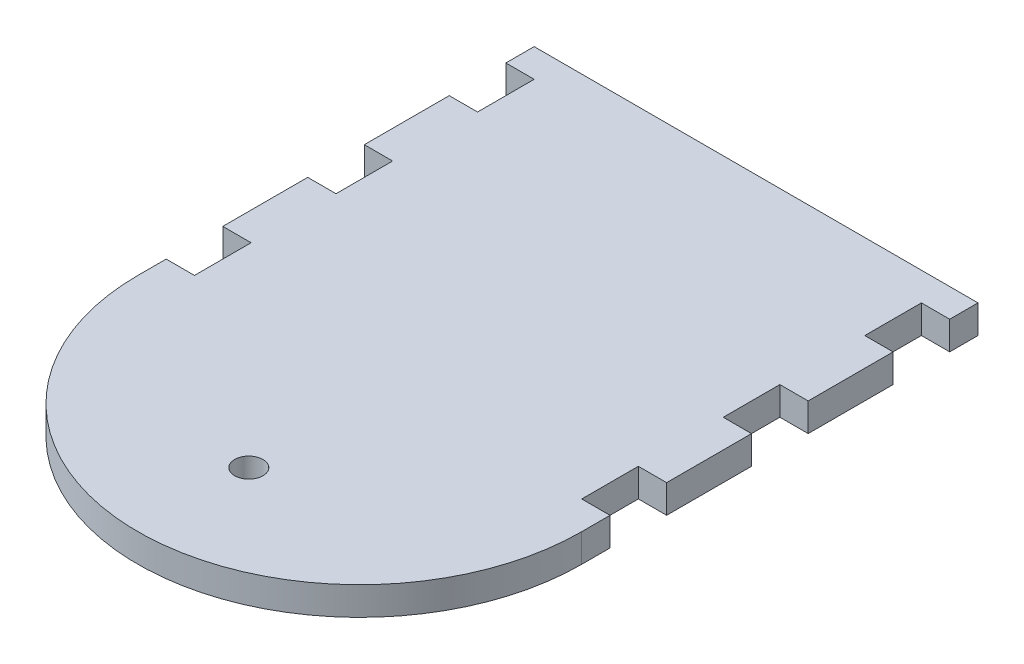
ISO-10303-21;
HEADER;
FILE_DESCRIPTION(('STEP AP214'),'2;1');
FILE_NAME('part.step','',(''),(''),'','','');
FILE_SCHEMA(('AUTOMOTIVE_DESIGN { 1 0 10303 214 1 1 1 1 }'));
ENDSEC;
DATA;
#1=APPLICATION_CONTEXT('core data for automotive mechanical design processes');
#2=APPLICATION_PROTOCOL_DEFINITION('international standard','automotive_design',2000,#1);
#3=PRODUCT_CONTEXT('',#1,'mechanical');
#4=PRODUCT('Part','Part','',(#3));
#5=PRODUCT_RELATED_PRODUCT_CATEGORY('part','',(#4));
#6=PRODUCT_DEFINITION_FORMATION('','',#4);
#7=PRODUCT_DEFINITION_CONTEXT('part definition',#1,'design');
#8=PRODUCT_DEFINITION('design','',#6,#7);
#9=PRODUCT_DEFINITION_SHAPE('','',#8);
#10=(LENGTH_UNIT() NAMED_UNIT(*) SI_UNIT(.MILLI.,.METRE.));
#11=(NAMED_UNIT(*) PLANE_ANGLE_UNIT() SI_UNIT($,.RADIAN.));
#12=(NAMED_UNIT(*) SI_UNIT($,.STERADIAN.) SOLID_ANGLE_UNIT());
#13=UNCERTAINTY_MEASURE_WITH_UNIT(LENGTH_MEASURE(1.E-05),#10,'distance_accuracy_value','');
#14=(GEOMETRIC_REPRESENTATION_CONTEXT(3) GLOBAL_UNCERTAINTY_ASSIGNED_CONTEXT((#13)) GLOBAL_UNIT_ASSIGNED_CONTEXT((#10,
#11,#12)) REPRESENTATION_CONTEXT('',''));
#15=CARTESIAN_POINT('',(0.,0.,0.));
#16=DIRECTION('',(0.,0.,1.));
#17=DIRECTION('',(1.,0.,0.));
#18=AXIS2_PLACEMENT_3D('',#15,#16,#17);
#19=CARTESIAN_POINT('',(0.,6.35,44.4499999999999));
#20=DIRECTION('',(0.,1.,0.));
#21=DIRECTION('',(0.,0.,1.));
#22=AXIS2_PLACEMENT_3D('',#19,#20,#21);
#23=PLANE('',#22);
#24=CARTESIAN_POINT('',(0.,6.35,44.4499999999999));
#25=DIRECTION('',(0.,1.,0.));
#26=DIRECTION('',(0.,0.,1.));
#27=AXIS2_PLACEMENT_3D('',#24,#25,#26);
#28=CIRCLE('',#27,49.784);
#29=CARTESIAN_POINT('',(-49.784,6.35,44.45));
#30=VERTEX_POINT('',#29);
#31=CARTESIAN_POINT('',(49.784,6.35,44.45));
#32=VERTEX_POINT('',#31);
#33=EDGE_CURVE('E305',#30,#32,#28,.T.);
#34=ORIENTED_EDGE('',*,*,#33,.T.);
#35=DIRECTION('',(0.,0.,-1.));
#36=VECTOR('',#35,1.);
#37=CARTESIAN_POINT('',(49.784,6.35,38.1000000000001));
#38=LINE('',#37,#36);
#39=CARTESIAN_POINT('',(49.784,6.35,38.1000000000001));
#40=VERTEX_POINT('',#39);
#41=EDGE_CURVE('E153',#32,#40,#38,.T.);
#42=ORIENTED_EDGE('',*,*,#41,.T.);
#43=DIRECTION('',(-1.,0.,0.));
#44=VECTOR('',#43,1.);
#45=CARTESIAN_POINT('',(43.434,6.35,38.1));
#46=LINE('',#45,#44);
#47=CARTESIAN_POINT('',(43.434,6.35,38.1));
#48=VERTEX_POINT('',#47);
#49=EDGE_CURVE('E380',#40,#48,#46,.T.);
#50=ORIENTED_EDGE('',*,*,#49,.T.);
#51=DIRECTION('',(0.,0.,-1.));
#52=VECTOR('',#51,1.);
#53=CARTESIAN_POINT('',(43.434,6.35,25.4));
#54=LINE('',#53,#52);
#55=CARTESIAN_POINT('',(43.434,6.35,25.4));
#56=VERTEX_POINT('',#55);
#57=EDGE_CURVE('E399',#48,#56,#54,.T.);
#58=ORIENTED_EDGE('',*,*,#57,.T.);
#59=DIRECTION('',(1.,0.,0.));
#60=VECTOR('',#59,1.);
#61=CARTESIAN_POINT('',(49.784,6.35,25.4));
#62=LINE('',#61,#60);
#63=CARTESIAN_POINT('',(49.784,6.35,25.4));
#64=VERTEX_POINT('',#63);
#65=EDGE_CURVE('E396',#56,#64,#62,.T.);
#66=ORIENTED_EDGE('',*,*,#65,.T.);
#67=DIRECTION('',(0.,0.,-1.));
#68=VECTOR('',#67,1.);
#69=CARTESIAN_POINT('',(49.784,6.35,6.35));
#70=LINE('',#69,#68);
#71=CARTESIAN_POINT('',(49.784,6.35,6.35));
#72=VERTEX_POINT('',#71);
#73=EDGE_CURVE('E398',#64,#72,#70,.T.);
#74=ORIENTED_EDGE('',*,*,#73,.T.);
#75=DIRECTION('',(-1.,0.,0.));
#76=VECTOR('',#75,1.);
#77=CARTESIAN_POINT('',(43.434,6.35,6.35));
#78=LINE('',#77,#76);
#79=CARTESIAN_POINT('',(43.434,6.35,6.35));
#80=VERTEX_POINT('',#79);
#81=EDGE_CURVE('E401',#72,#80,#78,.T.);
#82=ORIENTED_EDGE('',*,*,#81,.T.);
#83=DIRECTION('',(0.,0.,-1.));
#84=VECTOR('',#83,1.);
#85=CARTESIAN_POINT('',(43.434,6.35,-6.35));
#86=LINE('',#85,#84);
#87=CARTESIAN_POINT('',(43.434,6.35,-6.35));
#88=VERTEX_POINT('',#87);
#89=EDGE_CURVE('E407',#80,#88,#86,.T.);
#90=ORIENTED_EDGE('',*,*,#89,.T.);
#91=DIRECTION('',(1.,0.,0.));
#92=VECTOR('',#91,1.);
#93=CARTESIAN_POINT('',(49.784,6.35,-6.35));
#94=LINE('',#93,#92);
#95=CARTESIAN_POINT('',(49.784,6.35,-6.35));
#96=VERTEX_POINT('',#95);
#97=EDGE_CURVE('E409',#88,#96,#94,.T.);
#98=ORIENTED_EDGE('',*,*,#97,.T.);
#99=DIRECTION('',(0.,0.,-1.));
#100=VECTOR('',#99,1.);
#101=CARTESIAN_POINT('',(49.784,6.35,-25.4));
#102=LINE('',#101,#100);
#103=CARTESIAN_POINT('',(49.784,6.35,-25.4));
#104=VERTEX_POINT('',#103);
#105=EDGE_CURVE('E411',#96,#104,#102,.T.);
#106=ORIENTED_EDGE('',*,*,#105,.T.);
#107=DIRECTION('',(-1.,0.,0.));
#108=VECTOR('',#107,1.);
#109=CARTESIAN_POINT('',(43.434,6.35,-25.4));
#110=LINE('',#109,#108);
#111=CARTESIAN_POINT('',(43.434,6.35,-25.4));
#112=VERTEX_POINT('',#111);
#113=EDGE_CURVE('E413',#104,#112,#110,.T.);
#114=ORIENTED_EDGE('',*,*,#113,.T.);
#115=DIRECTION('',(0.,0.,-1.));
#116=VECTOR('',#115,1.);
#117=CARTESIAN_POINT('',(43.434,6.35,-38.1));
#118=LINE('',#117,#116);
#119=CARTESIAN_POINT('',(43.434,6.35,-38.1));
#120=VERTEX_POINT('',#119);
#121=EDGE_CURVE('E415',#112,#120,#118,.T.);
#122=ORIENTED_EDGE('',*,*,#121,.T.);
#123=DIRECTION('',(1.,0.,0.));
#124=VECTOR('',#123,1.);
#125=CARTESIAN_POINT('',(49.784,6.35,-38.1));
#126=LINE('',#125,#124);
#127=CARTESIAN_POINT('',(49.784,6.35,-38.1));
#128=VERTEX_POINT('',#127);
#129=EDGE_CURVE('E417',#120,#128,#126,.T.);
#130=ORIENTED_EDGE('',*,*,#129,.T.);
#131=DIRECTION('',(0.,0.,-1.));
#132=VECTOR('',#131,1.);
#133=CARTESIAN_POINT('',(49.784,6.35,-44.45));
#134=LINE('',#133,#132);
#135=CARTESIAN_POINT('',(49.784,6.35,-44.45));
#136=VERTEX_POINT('',#135);
#137=EDGE_CURVE('E419',#128,#136,#134,.T.);
#138=ORIENTED_EDGE('',*,*,#137,.T.);
#139=DIRECTION('',(-1.,0.,0.));
#140=VECTOR('',#139,1.);
#141=CARTESIAN_POINT('',(-49.784,6.35,-44.45));
#142=LINE('',#141,#140);
#143=CARTESIAN_POINT('',(-49.784,6.35,-44.45));
#144=VERTEX_POINT('',#143);
#145=EDGE_CURVE('E421',#136,#144,#142,.T.);
#146=ORIENTED_EDGE('',*,*,#145,.T.);
#147=DIRECTION('',(0.,0.,1.));
#148=VECTOR('',#147,1.);
#149=CARTESIAN_POINT('',(-49.784,6.35,-44.45));
#150=LINE('',#149,#148);
#151=CARTESIAN_POINT('',(-49.784,6.35,-38.0999999999999));
#152=VERTEX_POINT('',#151);
#153=EDGE_CURVE('E423',#144,#152,#150,.T.);
#154=ORIENTED_EDGE('',*,*,#153,.T.);
#155=DIRECTION('',(1.,0.,0.));
#156=VECTOR('',#155,1.);
#157=CARTESIAN_POINT('',(-49.784,6.35,-38.0999999999999));
#158=LINE('',#157,#156);
#159=CARTESIAN_POINT('',(-43.434,6.35,-38.0999999999999));
#160=VERTEX_POINT('',#159);
#161=EDGE_CURVE('E425',#152,#160,#158,.T.);
#162=ORIENTED_EDGE('',*,*,#161,.T.);
#163=DIRECTION('',(0.,0.,1.));
#164=VECTOR('',#163,1.);
#165=CARTESIAN_POINT('',(-43.434,6.35,-38.0999999999999));
#166=LINE('',#165,#164);
#167=CARTESIAN_POINT('',(-43.434,6.35,-25.4));
#168=VERTEX_POINT('',#167);
#169=EDGE_CURVE('E427',#160,#168,#166,.T.);
#170=ORIENTED_EDGE('',*,*,#169,.T.);
#171=DIRECTION('',(-1.,0.,0.));
#172=VECTOR('',#171,1.);
#173=CARTESIAN_POINT('',(-43.434,6.35,-25.4));
#174=LINE('',#173,#172);
#175=CARTESIAN_POINT('',(-49.784,6.35,-25.4));
#176=VERTEX_POINT('',#175);
#177=EDGE_CURVE('E429',#168,#176,#174,.T.);
#178=ORIENTED_EDGE('',*,*,#177,.T.);
#179=DIRECTION('',(0.,0.,1.));
#180=VECTOR('',#179,1.);
#181=CARTESIAN_POINT('',(-49.784,6.35,-25.4));
#182=LINE('',#181,#180);
#183=CARTESIAN_POINT('',(-49.784,6.35,-6.34999999999999));
#184=VERTEX_POINT('',#183);
#185=EDGE_CURVE('E431',#176,#184,#182,.T.);
#186=ORIENTED_EDGE('',*,*,#185,.T.);
#187=DIRECTION('',(1.,0.,0.));
#188=VECTOR('',#187,1.);
#189=CARTESIAN_POINT('',(-49.784,6.35,-6.34999999999999));
#190=LINE('',#189,#188);
#191=CARTESIAN_POINT('',(-43.434,6.35,-6.34999999999999));
#192=VERTEX_POINT('',#191);
#193=EDGE_CURVE('E433',#184,#192,#190,.T.);
#194=ORIENTED_EDGE('',*,*,#193,.T.);
#195=DIRECTION('',(0.,0.,1.));
#196=VECTOR('',#195,1.);
#197=CARTESIAN_POINT('',(-43.434,6.35,-6.34999999999999));
#198=LINE('',#197,#196);
#199=CARTESIAN_POINT('',(-43.434,6.35,6.35000000000001));
#200=VERTEX_POINT('',#199);
#201=EDGE_CURVE('E435',#192,#200,#198,.T.);
#202=ORIENTED_EDGE('',*,*,#201,.T.);
#203=DIRECTION('',(-1.,0.,0.));
#204=VECTOR('',#203,1.);
#205=CARTESIAN_POINT('',(-43.434,6.35,6.35000000000001));
#206=LINE('',#205,#204);
#207=CARTESIAN_POINT('',(-49.784,6.35,6.35000000000001));
#208=VERTEX_POINT('',#207);
#209=EDGE_CURVE('E437',#200,#208,#206,.T.);
#210=ORIENTED_EDGE('',*,*,#209,.T.);
#211=DIRECTION('',(0.,0.,1.));
#212=VECTOR('',#211,1.);
#213=CARTESIAN_POINT('',(-49.784,6.35,6.35000000000001));
#214=LINE('',#213,#212);
#215=CARTESIAN_POINT('',(-49.784,6.35,25.4));
#216=VERTEX_POINT('',#215);
#217=EDGE_CURVE('E439',#208,#216,#214,.T.);
#218=ORIENTED_EDGE('',*,*,#217,.T.);
#219=DIRECTION('',(1.,0.,0.));
#220=VECTOR('',#219,1.);
#221=CARTESIAN_POINT('',(-49.784,6.35,25.4));
#222=LINE('',#221,#220);
#223=CARTESIAN_POINT('',(-43.434,6.35,25.4));
#224=VERTEX_POINT('',#223);
#225=EDGE_CURVE('E232',#216,#224,#222,.T.);
#226=ORIENTED_EDGE('',*,*,#225,.T.);
#227=DIRECTION('',(0.,0.,1.));
#228=VECTOR('',#227,1.);
#229=CARTESIAN_POINT('',(-43.434,6.35,25.4));
#230=LINE('',#229,#228);
#231=CARTESIAN_POINT('',(-43.434,6.35,38.1000000000001));
#232=VERTEX_POINT('',#231);
#233=EDGE_CURVE('E226',#224,#232,#230,.T.);
#234=ORIENTED_EDGE('',*,*,#233,.T.);
#235=DIRECTION('',(-1.,0.,0.));
#236=VECTOR('',#235,1.);
#237=CARTESIAN_POINT('',(-43.434,6.35,38.1000000000001));
#238=LINE('',#237,#236);
#239=CARTESIAN_POINT('',(-49.784,6.35,38.1000000000001));
#240=VERTEX_POINT('',#239);
#241=EDGE_CURVE('E230',#232,#240,#238,.T.);
#242=ORIENTED_EDGE('',*,*,#241,.T.);
#243=DIRECTION('',(0.,0.,1.));
#244=VECTOR('',#243,1.);
#245=CARTESIAN_POINT('',(-49.784,6.35,38.1000000000001));
#246=LINE('',#245,#244);
#247=EDGE_CURVE('E50',#240,#30,#246,.T.);
#248=ORIENTED_EDGE('',*,*,#247,.T.);
#249=EDGE_LOOP('',(#34,#42,#50,#58,#66,#74,#82,#90,#98,#106,#114,#122,#130,#138,#146,#154,#162,
#170,#178,#186,#194,#202,#210,#218,#226,#234,#242,#248));
#250=FACE_BOUND('',#249,.T.);
#251=CARTESIAN_POINT('',(0.,6.35,69.342));
#252=DIRECTION('',(0.,1.,0.));
#253=DIRECTION('',(0.,0.,1.));
#254=AXIS2_PLACEMENT_3D('',#251,#252,#253);
#255=CIRCLE('',#254,3.175);
#256=CARTESIAN_POINT('',(0.,6.35,72.517));
#257=VERTEX_POINT('',#256);
#258=EDGE_CURVE('E254',#257,#257,#255,.T.);
#259=ORIENTED_EDGE('',*,*,#258,.F.);
#260=EDGE_LOOP('',(#259));
#261=FACE_BOUND('',#260,.T.);
#262=ADVANCED_FACE('F33',(#250,#261),#23,.T.);
#263=CARTESIAN_POINT('',(0.,0.,44.4499999999999));
#264=DIRECTION('',(0.,1.,0.));
#265=DIRECTION('',(0.,0.,1.));
#266=AXIS2_PLACEMENT_3D('',#263,#264,#265);
#267=PLANE('',#266);
#268=CARTESIAN_POINT('',(0.,0.,44.4499999999999));
#269=DIRECTION('',(0.,1.,0.));
#270=DIRECTION('',(0.,0.,1.));
#271=AXIS2_PLACEMENT_3D('',#268,#269,#270);
#272=CIRCLE('',#271,49.784);
#273=CARTESIAN_POINT('',(-49.784,0.,44.45));
#274=VERTEX_POINT('',#273);
#275=CARTESIAN_POINT('',(49.784,0.,44.45));
#276=VERTEX_POINT('',#275);
#277=EDGE_CURVE('E250',#274,#276,#272,.T.);
#278=ORIENTED_EDGE('',*,*,#277,.F.);
#279=DIRECTION('',(0.,0.,1.));
#280=VECTOR('',#279,1.);
#281=CARTESIAN_POINT('',(-49.784,0.,38.1000000000001));
#282=LINE('',#281,#280);
#283=CARTESIAN_POINT('',(-49.784,0.,38.1000000000001));
#284=VERTEX_POINT('',#283);
#285=EDGE_CURVE('E145',#284,#274,#282,.T.);
#286=ORIENTED_EDGE('',*,*,#285,.F.);
#287=DIRECTION('',(-1.,0.,0.));
#288=VECTOR('',#287,1.);
#289=CARTESIAN_POINT('',(-43.434,0.,38.1000000000001));
#290=LINE('',#289,#288);
#291=CARTESIAN_POINT('',(-43.434,0.,38.1000000000001));
#292=VERTEX_POINT('',#291);
#293=EDGE_CURVE('E139',#292,#284,#290,.T.);
#294=ORIENTED_EDGE('',*,*,#293,.F.);
#295=DIRECTION('',(0.,0.,1.));
#296=VECTOR('',#295,1.);
#297=CARTESIAN_POINT('',(-43.434,0.,25.4));
#298=LINE('',#297,#296);
#299=CARTESIAN_POINT('',(-43.434,0.,25.4));
#300=VERTEX_POINT('',#299);
#301=EDGE_CURVE('E240',#300,#292,#298,.T.);
#302=ORIENTED_EDGE('',*,*,#301,.F.);
#303=DIRECTION('',(1.,0.,0.));
#304=VECTOR('',#303,1.);
#305=CARTESIAN_POINT('',(-49.784,0.,25.4));
#306=LINE('',#305,#304);
#307=CARTESIAN_POINT('',(-49.784,0.,25.4));
#308=VERTEX_POINT('',#307);
#309=EDGE_CURVE('E300',#308,#300,#306,.T.);
#310=ORIENTED_EDGE('',*,*,#309,.F.);
#311=DIRECTION('',(0.,0.,1.));
#312=VECTOR('',#311,1.);
#313=CARTESIAN_POINT('',(-49.784,0.,6.35000000000001));
#314=LINE('',#313,#312);
#315=CARTESIAN_POINT('',(-49.784,0.,6.35000000000001));
#316=VERTEX_POINT('',#315);
#317=EDGE_CURVE('E298',#316,#308,#314,.T.);
#318=ORIENTED_EDGE('',*,*,#317,.F.);
#319=DIRECTION('',(-1.,0.,0.));
#320=VECTOR('',#319,1.);
#321=CARTESIAN_POINT('',(-43.434,0.,6.35000000000001));
#322=LINE('',#321,#320);
#323=CARTESIAN_POINT('',(-43.434,0.,6.35000000000001));
#324=VERTEX_POINT('',#323);
#325=EDGE_CURVE('E296',#324,#316,#322,.T.);
#326=ORIENTED_EDGE('',*,*,#325,.F.);
#327=DIRECTION('',(0.,0.,1.));
#328=VECTOR('',#327,1.);
#329=CARTESIAN_POINT('',(-43.434,0.,-6.34999999999999));
#330=LINE('',#329,#328);
#331=CARTESIAN_POINT('',(-43.434,0.,-6.34999999999999));
#332=VERTEX_POINT('',#331);
#333=EDGE_CURVE('E294',#332,#324,#330,.T.);
#334=ORIENTED_EDGE('',*,*,#333,.F.);
#335=DIRECTION('',(1.,0.,0.));
#336=VECTOR('',#335,1.);
#337=CARTESIAN_POINT('',(-49.784,0.,-6.34999999999999));
#338=LINE('',#337,#336);
#339=CARTESIAN_POINT('',(-49.784,0.,-6.34999999999999));
#340=VERTEX_POINT('',#339);
#341=EDGE_CURVE('E292',#340,#332,#338,.T.);
#342=ORIENTED_EDGE('',*,*,#341,.F.);
#343=DIRECTION('',(0.,0.,1.));
#344=VECTOR('',#343,1.);
#345=CARTESIAN_POINT('',(-49.784,0.,-25.4));
#346=LINE('',#345,#344);
#347=CARTESIAN_POINT('',(-49.784,0.,-25.4));
#348=VERTEX_POINT('',#347);
#349=EDGE_CURVE('E290',#348,#340,#346,.T.);
#350=ORIENTED_EDGE('',*,*,#349,.F.);
#351=DIRECTION('',(-1.,0.,0.));
#352=VECTOR('',#351,1.);
#353=CARTESIAN_POINT('',(-43.434,0.,-25.4));
#354=LINE('',#353,#352);
#355=CARTESIAN_POINT('',(-43.434,0.,-25.4));
#356=VERTEX_POINT('',#355);
#357=EDGE_CURVE('E288',#356,#348,#354,.T.);
#358=ORIENTED_EDGE('',*,*,#357,.F.);
#359=DIRECTION('',(0.,0.,1.));
#360=VECTOR('',#359,1.);
#361=CARTESIAN_POINT('',(-43.434,0.,-38.0999999999999));
#362=LINE('',#361,#360);
#363=CARTESIAN_POINT('',(-43.434,0.,-38.0999999999999));
#364=VERTEX_POINT('',#363);
#365=EDGE_CURVE('E286',#364,#356,#362,.T.);
#366=ORIENTED_EDGE('',*,*,#365,.F.);
#367=DIRECTION('',(1.,0.,0.));
#368=VECTOR('',#367,1.);
#369=CARTESIAN_POINT('',(-49.784,0.,-38.0999999999999));
#370=LINE('',#369,#368);
#371=CARTESIAN_POINT('',(-49.784,0.,-38.0999999999999));
#372=VERTEX_POINT('',#371);
#373=EDGE_CURVE('E284',#372,#364,#370,.T.);
#374=ORIENTED_EDGE('',*,*,#373,.F.);
#375=DIRECTION('',(0.,0.,1.));
#376=VECTOR('',#375,1.);
#377=CARTESIAN_POINT('',(-49.784,0.,-44.45));
#378=LINE('',#377,#376);
#379=CARTESIAN_POINT('',(-49.784,0.,-44.45));
#380=VERTEX_POINT('',#379);
#381=EDGE_CURVE('E282',#380,#372,#378,.T.);
#382=ORIENTED_EDGE('',*,*,#381,.F.);
#383=DIRECTION('',(-1.,0.,0.));
#384=VECTOR('',#383,1.);
#385=CARTESIAN_POINT('',(-49.784,0.,-44.45));
#386=LINE('',#385,#384);
#387=CARTESIAN_POINT('',(49.784,0.,-44.45));
#388=VERTEX_POINT('',#387);
#389=EDGE_CURVE('E280',#388,#380,#386,.T.);
#390=ORIENTED_EDGE('',*,*,#389,.F.);
#391=DIRECTION('',(0.,0.,-1.));
#392=VECTOR('',#391,1.);
#393=CARTESIAN_POINT('',(49.784,0.,-44.45));
#394=LINE('',#393,#392);
#395=CARTESIAN_POINT('',(49.784,0.,-38.1));
#396=VERTEX_POINT('',#395);
#397=EDGE_CURVE('E278',#396,#388,#394,.T.);
#398=ORIENTED_EDGE('',*,*,#397,.F.);
#399=DIRECTION('',(1.,0.,0.));
#400=VECTOR('',#399,1.);
#401=CARTESIAN_POINT('',(49.784,0.,-38.1));
#402=LINE('',#401,#400);
#403=CARTESIAN_POINT('',(43.434,0.,-38.1));
#404=VERTEX_POINT('',#403);
#405=EDGE_CURVE('E276',#404,#396,#402,.T.);
#406=ORIENTED_EDGE('',*,*,#405,.F.);
#407=DIRECTION('',(0.,0.,-1.));
#408=VECTOR('',#407,1.);
#409=CARTESIAN_POINT('',(43.434,0.,-38.1));
#410=LINE('',#409,#408);
#411=CARTESIAN_POINT('',(43.434,0.,-25.4));
#412=VERTEX_POINT('',#411);
#413=EDGE_CURVE('E274',#412,#404,#410,.T.);
#414=ORIENTED_EDGE('',*,*,#413,.F.);
#415=DIRECTION('',(-1.,0.,0.));
#416=VECTOR('',#415,1.);
#417=CARTESIAN_POINT('',(43.434,0.,-25.4));
#418=LINE('',#417,#416);
#419=CARTESIAN_POINT('',(49.784,0.,-25.4));
#420=VERTEX_POINT('',#419);
#421=EDGE_CURVE('E272',#420,#412,#418,.T.);
#422=ORIENTED_EDGE('',*,*,#421,.F.);
#423=DIRECTION('',(0.,0.,-1.));
#424=VECTOR('',#423,1.);
#425=CARTESIAN_POINT('',(49.784,0.,-25.4));
#426=LINE('',#425,#424);
#427=CARTESIAN_POINT('',(49.784,0.,-6.35));
#428=VERTEX_POINT('',#427);
#429=EDGE_CURVE('E270',#428,#420,#426,.T.);
#430=ORIENTED_EDGE('',*,*,#429,.F.);
#431=DIRECTION('',(1.,0.,0.));
#432=VECTOR('',#431,1.);
#433=CARTESIAN_POINT('',(49.784,0.,-6.35));
#434=LINE('',#433,#432);
#435=CARTESIAN_POINT('',(43.434,0.,-6.35));
#436=VERTEX_POINT('',#435);
#437=EDGE_CURVE('E268',#436,#428,#434,.T.);
#438=ORIENTED_EDGE('',*,*,#437,.F.);
#439=DIRECTION('',(0.,0.,-1.));
#440=VECTOR('',#439,1.);
#441=CARTESIAN_POINT('',(43.434,0.,-6.35));
#442=LINE('',#441,#440);
#443=CARTESIAN_POINT('',(43.434,0.,6.35));
#444=VERTEX_POINT('',#443);
#445=EDGE_CURVE('E266',#444,#436,#442,.T.);
#446=ORIENTED_EDGE('',*,*,#445,.F.);
#447=DIRECTION('',(-1.,0.,0.));
#448=VECTOR('',#447,1.);
#449=CARTESIAN_POINT('',(43.434,0.,6.35));
#450=LINE('',#449,#448);
#451=CARTESIAN_POINT('',(49.784,0.,6.35));
#452=VERTEX_POINT('',#451);
#453=EDGE_CURVE('E264',#452,#444,#450,.T.);
#454=ORIENTED_EDGE('',*,*,#453,.F.);
#455=DIRECTION('',(0.,0.,-1.));
#456=VECTOR('',#455,1.);
#457=CARTESIAN_POINT('',(49.784,0.,6.35));
#458=LINE('',#457,#456);
#459=CARTESIAN_POINT('',(49.784,0.,25.4));
#460=VERTEX_POINT('',#459);
#461=EDGE_CURVE('E262',#460,#452,#458,.T.);
#462=ORIENTED_EDGE('',*,*,#461,.F.);
#463=DIRECTION('',(1.,0.,0.));
#464=VECTOR('',#463,1.);
#465=CARTESIAN_POINT('',(49.784,0.,25.4));
#466=LINE('',#465,#464);
#467=CARTESIAN_POINT('',(43.434,0.,25.4));
#468=VERTEX_POINT('',#467);
#469=EDGE_CURVE('E260',#468,#460,#466,.T.);
#470=ORIENTED_EDGE('',*,*,#469,.F.);
#471=DIRECTION('',(0.,0.,-1.));
#472=VECTOR('',#471,1.);
#473=CARTESIAN_POINT('',(43.434,0.,25.4));
#474=LINE('',#473,#472);
#475=CARTESIAN_POINT('',(43.434,0.,38.1));
#476=VERTEX_POINT('',#475);
#477=EDGE_CURVE('E258',#476,#468,#474,.T.);
#478=ORIENTED_EDGE('',*,*,#477,.F.);
#479=DIRECTION('',(-1.,0.,0.));
#480=VECTOR('',#479,1.);
#481=CARTESIAN_POINT('',(43.434,0.,38.1));
#482=LINE('',#481,#480);
#483=CARTESIAN_POINT('',(49.784,0.,38.1000000000001));
#484=VERTEX_POINT('',#483);
#485=EDGE_CURVE('E256',#484,#476,#482,.T.);
#486=ORIENTED_EDGE('',*,*,#485,.F.);
#487=DIRECTION('',(0.,0.,-1.));
#488=VECTOR('',#487,1.);
#489=CARTESIAN_POINT('',(49.784,0.,38.1000000000001));
#490=LINE('',#489,#488);
#491=EDGE_CURVE('E253',#276,#484,#490,.T.);
#492=ORIENTED_EDGE('',*,*,#491,.F.);
#493=EDGE_LOOP('',(#278,#286,#294,#302,#310,#318,#326,#334,#342,#350,#358,#366,#374,#382,#390,
#398,#406,#414,#422,#430,#438,#446,#454,#462,#470,#478,#486,#492));
#494=FACE_BOUND('',#493,.T.);
#495=CARTESIAN_POINT('',(0.,0.,69.342));
#496=DIRECTION('',(0.,1.,0.));
#497=DIRECTION('',(0.,0.,1.));
#498=AXIS2_PLACEMENT_3D('',#495,#496,#497);
#499=CIRCLE('',#498,3.175);
#500=CARTESIAN_POINT('',(0.,0.,72.517));
#501=VERTEX_POINT('',#500);
#502=EDGE_CURVE('E794',#501,#501,#499,.T.);
#503=ORIENTED_EDGE('',*,*,#502,.T.);
#504=EDGE_LOOP('',(#503));
#505=FACE_BOUND('',#504,.T.);
#506=ADVANCED_FACE('F384',(#494,#505),#267,.F.);
#507=CARTESIAN_POINT('',(0.,6.35,44.4499999999999));
#508=DIRECTION('',(0.,-1.,0.));
#509=DIRECTION('',(0.,0.,-1.));
#510=AXIS2_PLACEMENT_3D('',#507,#508,#509);
#511=CYLINDRICAL_SURFACE('',#510,49.784);
#512=ORIENTED_EDGE('',*,*,#277,.T.);
#513=DIRECTION('',(0.,-1.,0.));
#514=VECTOR('',#513,1.);
#515=CARTESIAN_POINT('',(49.784,6.35,44.45));
#516=LINE('',#515,#514);
#517=EDGE_CURVE('E11',#32,#276,#516,.T.);
#518=ORIENTED_EDGE('',*,*,#517,.F.);
#519=ORIENTED_EDGE('',*,*,#33,.F.);
#520=DIRECTION('',(0.,-1.,0.));
#521=VECTOR('',#520,1.);
#522=CARTESIAN_POINT('',(-49.784,6.35,44.45));
#523=LINE('',#522,#521);
#524=EDGE_CURVE('E246',#30,#274,#523,.T.);
#525=ORIENTED_EDGE('',*,*,#524,.T.);
#526=EDGE_LOOP('',(#512,#518,#519,#525));
#527=FACE_BOUND('',#526,.T.);
#528=ADVANCED_FACE('F35',(#527),#511,.T.);
#529=CARTESIAN_POINT('',(49.784,6.35,38.1000000000001));
#530=DIRECTION('',(-1.,0.,0.));
#531=DIRECTION('',(0.,0.,1.));
#532=AXIS2_PLACEMENT_3D('',#529,#530,#531);
#533=PLANE('',#532);
#534=ORIENTED_EDGE('',*,*,#491,.T.);
#535=DIRECTION('',(0.,-1.,0.));
#536=VECTOR('',#535,1.);
#537=CARTESIAN_POINT('',(49.784,6.35,38.1000000000001));
#538=LINE('',#537,#536);
#539=EDGE_CURVE('E42',#40,#484,#538,.T.);
#540=ORIENTED_EDGE('',*,*,#539,.F.);
#541=ORIENTED_EDGE('',*,*,#41,.F.);
#542=ORIENTED_EDGE('',*,*,#517,.T.);
#543=EDGE_LOOP('',(#534,#540,#541,#542));
#544=FACE_BOUND('',#543,.T.);
#545=ADVANCED_FACE('F473',(#544),#533,.F.);
#546=CARTESIAN_POINT('',(43.434,6.35,38.1));
#547=DIRECTION('',(0.,0.,1.));
#548=DIRECTION('',(1.,0.,0.));
#549=AXIS2_PLACEMENT_3D('',#546,#547,#548);
#550=PLANE('',#549);
#551=ORIENTED_EDGE('',*,*,#485,.T.);
#552=DIRECTION('',(0.,-1.,0.));
#553=VECTOR('',#552,1.);
#554=CARTESIAN_POINT('',(43.434,6.35,38.1));
#555=LINE('',#554,#553);
#556=EDGE_CURVE('E372',#48,#476,#555,.T.);
#557=ORIENTED_EDGE('',*,*,#556,.F.);
#558=ORIENTED_EDGE('',*,*,#49,.F.);
#559=ORIENTED_EDGE('',*,*,#539,.T.);
#560=EDGE_LOOP('',(#551,#557,#558,#559));
#561=FACE_BOUND('',#560,.T.);
#562=ADVANCED_FACE('F378',(#561),#550,.F.);
#563=CARTESIAN_POINT('',(43.434,6.35,25.4));
#564=DIRECTION('',(-1.,0.,0.));
#565=DIRECTION('',(0.,0.,1.));
#566=AXIS2_PLACEMENT_3D('',#563,#564,#565);
#567=PLANE('',#566);
#568=ORIENTED_EDGE('',*,*,#477,.T.);
#569=DIRECTION('',(0.,-1.,0.));
#570=VECTOR('',#569,1.);
#571=CARTESIAN_POINT('',(43.434,6.35,25.4));
#572=LINE('',#571,#570);
#573=EDGE_CURVE('E369',#56,#468,#572,.T.);
#574=ORIENTED_EDGE('',*,*,#573,.F.);
#575=ORIENTED_EDGE('',*,*,#57,.F.);
#576=ORIENTED_EDGE('',*,*,#556,.T.);
#577=EDGE_LOOP('',(#568,#574,#575,#576));
#578=FACE_BOUND('',#577,.T.);
#579=ADVANCED_FACE('F390',(#578),#567,.F.);
#580=CARTESIAN_POINT('',(49.784,6.35,25.4));
#581=DIRECTION('',(0.,0.,-1.));
#582=DIRECTION('',(-1.,0.,0.));
#583=AXIS2_PLACEMENT_3D('',#580,#581,#582);
#584=PLANE('',#583);
#585=ORIENTED_EDGE('',*,*,#469,.T.);
#586=DIRECTION('',(0.,-1.,0.));
#587=VECTOR('',#586,1.);
#588=CARTESIAN_POINT('',(49.784,6.35,25.4));
#589=LINE('',#588,#587);
#590=EDGE_CURVE('E366',#64,#460,#589,.T.);
#591=ORIENTED_EDGE('',*,*,#590,.F.);
#592=ORIENTED_EDGE('',*,*,#65,.F.);
#593=ORIENTED_EDGE('',*,*,#573,.T.);
#594=EDGE_LOOP('',(#585,#591,#592,#593));
#595=FACE_BOUND('',#594,.T.);
#596=ADVANCED_FACE('F394',(#595),#584,.F.);
#597=CARTESIAN_POINT('',(49.784,6.35,6.35));
#598=DIRECTION('',(-1.,0.,0.));
#599=DIRECTION('',(0.,0.,1.));
#600=AXIS2_PLACEMENT_3D('',#597,#598,#599);
#601=PLANE('',#600);
#602=ORIENTED_EDGE('',*,*,#461,.T.);
#603=DIRECTION('',(0.,-1.,0.));
#604=VECTOR('',#603,1.);
#605=CARTESIAN_POINT('',(49.784,6.35,6.35));
#606=LINE('',#605,#604);
#607=EDGE_CURVE('E363',#72,#452,#606,.T.);
#608=ORIENTED_EDGE('',*,*,#607,.F.);
#609=ORIENTED_EDGE('',*,*,#73,.F.);
#610=ORIENTED_EDGE('',*,*,#590,.T.);
#611=EDGE_LOOP('',(#602,#608,#609,#610));
#612=FACE_BOUND('',#611,.T.);
#613=ADVANCED_FACE('F486',(#612),#601,.F.);
#614=CARTESIAN_POINT('',(43.434,6.35,6.35));
#615=DIRECTION('',(0.,0.,1.));
#616=DIRECTION('',(1.,0.,0.));
#617=AXIS2_PLACEMENT_3D('',#614,#615,#616);
#618=PLANE('',#617);
#619=ORIENTED_EDGE('',*,*,#453,.T.);
#620=DIRECTION('',(0.,-1.,0.));
#621=VECTOR('',#620,1.);
#622=CARTESIAN_POINT('',(43.434,6.35,6.35));
#623=LINE('',#622,#621);
#624=EDGE_CURVE('E360',#80,#444,#623,.T.);
#625=ORIENTED_EDGE('',*,*,#624,.F.);
#626=ORIENTED_EDGE('',*,*,#81,.F.);
#627=ORIENTED_EDGE('',*,*,#607,.T.);
#628=EDGE_LOOP('',(#619,#625,#626,#627));
#629=FACE_BOUND('',#628,.T.);
#630=ADVANCED_FACE('F489',(#629),#618,.F.);
#631=CARTESIAN_POINT('',(43.434,6.35,-6.35));
#632=DIRECTION('',(-1.,0.,0.));
#633=DIRECTION('',(0.,0.,1.));
#634=AXIS2_PLACEMENT_3D('',#631,#632,#633);
#635=PLANE('',#634);
#636=ORIENTED_EDGE('',*,*,#445,.T.);
#637=DIRECTION('',(0.,-1.,0.));
#638=VECTOR('',#637,1.);
#639=CARTESIAN_POINT('',(43.434,6.35,-6.35));
#640=LINE('',#639,#638);
#641=EDGE_CURVE('E357',#88,#436,#640,.T.);
#642=ORIENTED_EDGE('',*,*,#641,.F.);
#643=ORIENTED_EDGE('',*,*,#89,.F.);
#644=ORIENTED_EDGE('',*,*,#624,.T.);
#645=EDGE_LOOP('',(#636,#642,#643,#644));
#646=FACE_BOUND('',#645,.T.);
#647=ADVANCED_FACE('F493',(#646),#635,.F.);
#648=CARTESIAN_POINT('',(49.784,6.35,-6.35));
#649=DIRECTION('',(0.,0.,-1.));
#650=DIRECTION('',(-1.,0.,0.));
#651=AXIS2_PLACEMENT_3D('',#648,#649,#650);
#652=PLANE('',#651);
#653=ORIENTED_EDGE('',*,*,#437,.T.);
#654=DIRECTION('',(0.,-1.,0.));
#655=VECTOR('',#654,1.);
#656=CARTESIAN_POINT('',(49.784,6.35,-6.35));
#657=LINE('',#656,#655);
#658=EDGE_CURVE('E354',#96,#428,#657,.T.);
#659=ORIENTED_EDGE('',*,*,#658,.F.);
#660=ORIENTED_EDGE('',*,*,#97,.F.);
#661=ORIENTED_EDGE('',*,*,#641,.T.);
#662=EDGE_LOOP('',(#653,#659,#660,#661));
#663=FACE_BOUND('',#662,.T.);
#664=ADVANCED_FACE('F497',(#663),#652,.F.);
#665=CARTESIAN_POINT('',(49.784,6.35,-25.4));
#666=DIRECTION('',(-1.,0.,0.));
#667=DIRECTION('',(0.,0.,1.));
#668=AXIS2_PLACEMENT_3D('',#665,#666,#667);
#669=PLANE('',#668);
#670=ORIENTED_EDGE('',*,*,#429,.T.);
#671=DIRECTION('',(0.,-1.,0.));
#672=VECTOR('',#671,1.);
#673=CARTESIAN_POINT('',(49.784,6.35,-25.4));
#674=LINE('',#673,#672);
#675=EDGE_CURVE('E351',#104,#420,#674,.T.);
#676=ORIENTED_EDGE('',*,*,#675,.F.);
#677=ORIENTED_EDGE('',*,*,#105,.F.);
#678=ORIENTED_EDGE('',*,*,#658,.T.);
#679=EDGE_LOOP('',(#670,#676,#677,#678));
#680=FACE_BOUND('',#679,.T.);
#681=ADVANCED_FACE('F501',(#680),#669,.F.);
#682=CARTESIAN_POINT('',(43.434,6.35,-25.4));
#683=DIRECTION('',(0.,0.,1.));
#684=DIRECTION('',(1.,0.,0.));
#685=AXIS2_PLACEMENT_3D('',#682,#683,#684);
#686=PLANE('',#685);
#687=ORIENTED_EDGE('',*,*,#421,.T.);
#688=DIRECTION('',(0.,-1.,0.));
#689=VECTOR('',#688,1.);
#690=CARTESIAN_POINT('',(43.434,6.35,-25.4));
#691=LINE('',#690,#689);
#692=EDGE_CURVE('E348',#112,#412,#691,.T.);
#693=ORIENTED_EDGE('',*,*,#692,.F.);
#694=ORIENTED_EDGE('',*,*,#113,.F.);
#695=ORIENTED_EDGE('',*,*,#675,.T.);
#696=EDGE_LOOP('',(#687,#693,#694,#695));
#697=FACE_BOUND('',#696,.T.);
#698=ADVANCED_FACE('F505',(#697),#686,.F.);
#699=CARTESIAN_POINT('',(43.434,6.35,-38.1));
#700=DIRECTION('',(-1.,0.,0.));
#701=DIRECTION('',(0.,0.,1.));
#702=AXIS2_PLACEMENT_3D('',#699,#700,#701);
#703=PLANE('',#702);
#704=ORIENTED_EDGE('',*,*,#413,.T.);
#705=DIRECTION('',(0.,-1.,0.));
#706=VECTOR('',#705,1.);
#707=CARTESIAN_POINT('',(43.434,6.35,-38.1));
#708=LINE('',#707,#706);
#709=EDGE_CURVE('E345',#120,#404,#708,.T.);
#710=ORIENTED_EDGE('',*,*,#709,.F.);
#711=ORIENTED_EDGE('',*,*,#121,.F.);
#712=ORIENTED_EDGE('',*,*,#692,.T.);
#713=EDGE_LOOP('',(#704,#710,#711,#712));
#714=FACE_BOUND('',#713,.T.);
#715=ADVANCED_FACE('F509',(#714),#703,.F.);
#716=CARTESIAN_POINT('',(49.784,6.35,-38.1));
#717=DIRECTION('',(0.,0.,-1.));
#718=DIRECTION('',(-1.,0.,0.));
#719=AXIS2_PLACEMENT_3D('',#716,#717,#718);
#720=PLANE('',#719);
#721=ORIENTED_EDGE('',*,*,#405,.T.);
#722=DIRECTION('',(0.,-1.,0.));
#723=VECTOR('',#722,1.);
#724=CARTESIAN_POINT('',(49.784,6.35,-38.1));
#725=LINE('',#724,#723);
#726=EDGE_CURVE('E342',#128,#396,#725,.T.);
#727=ORIENTED_EDGE('',*,*,#726,.F.);
#728=ORIENTED_EDGE('',*,*,#129,.F.);
#729=ORIENTED_EDGE('',*,*,#709,.T.);
#730=EDGE_LOOP('',(#721,#727,#728,#729));
#731=FACE_BOUND('',#730,.T.);
#732=ADVANCED_FACE('F513',(#731),#720,.F.);
#733=CARTESIAN_POINT('',(49.784,6.35,-44.45));
#734=DIRECTION('',(-1.,0.,0.));
#735=DIRECTION('',(0.,0.,1.));
#736=AXIS2_PLACEMENT_3D('',#733,#734,#735);
#737=PLANE('',#736);
#738=ORIENTED_EDGE('',*,*,#397,.T.);
#739=DIRECTION('',(0.,-1.,0.));
#740=VECTOR('',#739,1.);
#741=CARTESIAN_POINT('',(49.784,6.35,-44.45));
#742=LINE('',#741,#740);
#743=EDGE_CURVE('E339',#136,#388,#742,.T.);
#744=ORIENTED_EDGE('',*,*,#743,.F.);
#745=ORIENTED_EDGE('',*,*,#137,.F.);
#746=ORIENTED_EDGE('',*,*,#726,.T.);
#747=EDGE_LOOP('',(#738,#744,#745,#746));
#748=FACE_BOUND('',#747,.T.);
#749=ADVANCED_FACE('F517',(#748),#737,.F.);
#750=CARTESIAN_POINT('',(-49.784,6.35,-44.45));
#751=DIRECTION('',(0.,0.,1.));
#752=DIRECTION('',(1.,0.,0.));
#753=AXIS2_PLACEMENT_3D('',#750,#751,#752);
#754=PLANE('',#753);
#755=ORIENTED_EDGE('',*,*,#389,.T.);
#756=DIRECTION('',(0.,-1.,0.));
#757=VECTOR('',#756,1.);
#758=CARTESIAN_POINT('',(-49.784,6.35,-44.45));
#759=LINE('',#758,#757);
#760=EDGE_CURVE('E336',#144,#380,#759,.T.);
#761=ORIENTED_EDGE('',*,*,#760,.F.);
#762=ORIENTED_EDGE('',*,*,#145,.F.);
#763=ORIENTED_EDGE('',*,*,#743,.T.);
#764=EDGE_LOOP('',(#755,#761,#762,#763));
#765=FACE_BOUND('',#764,.T.);
#766=ADVANCED_FACE('F521',(#765),#754,.F.);
#767=CARTESIAN_POINT('',(-49.784,6.35,-44.45));
#768=DIRECTION('',(1.,0.,0.));
#769=DIRECTION('',(0.,0.,-1.));
#770=AXIS2_PLACEMENT_3D('',#767,#768,#769);
#771=PLANE('',#770);
#772=ORIENTED_EDGE('',*,*,#381,.T.);
#773=DIRECTION('',(0.,-1.,0.));
#774=VECTOR('',#773,1.);
#775=CARTESIAN_POINT('',(-49.784,6.35,-38.0999999999999));
#776=LINE('',#775,#774);
#777=EDGE_CURVE('E333',#152,#372,#776,.T.);
#778=ORIENTED_EDGE('',*,*,#777,.F.);
#779=ORIENTED_EDGE('',*,*,#153,.F.);
#780=ORIENTED_EDGE('',*,*,#760,.T.);
#781=EDGE_LOOP('',(#772,#778,#779,#780));
#782=FACE_BOUND('',#781,.T.);
#783=ADVANCED_FACE('F525',(#782),#771,.F.);
#784=CARTESIAN_POINT('',(-49.784,6.35,-38.0999999999999));
#785=DIRECTION('',(0.,0.,-1.));
#786=DIRECTION('',(-1.,0.,0.));
#787=AXIS2_PLACEMENT_3D('',#784,#785,#786);
#788=PLANE('',#787);
#789=ORIENTED_EDGE('',*,*,#373,.T.);
#790=DIRECTION('',(0.,-1.,0.));
#791=VECTOR('',#790,1.);
#792=CARTESIAN_POINT('',(-43.434,6.35,-38.0999999999999));
#793=LINE('',#792,#791);
#794=EDGE_CURVE('E330',#160,#364,#793,.T.);
#795=ORIENTED_EDGE('',*,*,#794,.F.);
#796=ORIENTED_EDGE('',*,*,#161,.F.);
#797=ORIENTED_EDGE('',*,*,#777,.T.);
#798=EDGE_LOOP('',(#789,#795,#796,#797));
#799=FACE_BOUND('',#798,.T.);
#800=ADVANCED_FACE('F529',(#799),#788,.F.);
#801=CARTESIAN_POINT('',(-43.434,6.35,-38.0999999999999));
#802=DIRECTION('',(1.,0.,0.));
#803=DIRECTION('',(0.,0.,-1.));
#804=AXIS2_PLACEMENT_3D('',#801,#802,#803);
#805=PLANE('',#804);
#806=ORIENTED_EDGE('',*,*,#365,.T.);
#807=DIRECTION('',(0.,-1.,0.));
#808=VECTOR('',#807,1.);
#809=CARTESIAN_POINT('',(-43.434,6.35,-25.4));
#810=LINE('',#809,#808);
#811=EDGE_CURVE('E327',#168,#356,#810,.T.);
#812=ORIENTED_EDGE('',*,*,#811,.F.);
#813=ORIENTED_EDGE('',*,*,#169,.F.);
#814=ORIENTED_EDGE('',*,*,#794,.T.);
#815=EDGE_LOOP('',(#806,#812,#813,#814));
#816=FACE_BOUND('',#815,.T.);
#817=ADVANCED_FACE('F533',(#816),#805,.F.);
#818=CARTESIAN_POINT('',(-43.434,6.35,-25.4));
#819=DIRECTION('',(0.,0.,1.));
#820=DIRECTION('',(1.,0.,0.));
#821=AXIS2_PLACEMENT_3D('',#818,#819,#820);
#822=PLANE('',#821);
#823=ORIENTED_EDGE('',*,*,#357,.T.);
#824=DIRECTION('',(0.,-1.,0.));
#825=VECTOR('',#824,1.);
#826=CARTESIAN_POINT('',(-49.784,6.35,-25.4));
#827=LINE('',#826,#825);
#828=EDGE_CURVE('E324',#176,#348,#827,.T.);
#829=ORIENTED_EDGE('',*,*,#828,.F.);
#830=ORIENTED_EDGE('',*,*,#177,.F.);
#831=ORIENTED_EDGE('',*,*,#811,.T.);
#832=EDGE_LOOP('',(#823,#829,#830,#831));
#833=FACE_BOUND('',#832,.T.);
#834=ADVANCED_FACE('F537',(#833),#822,.F.);
#835=CARTESIAN_POINT('',(-49.784,6.35,-25.4));
#836=DIRECTION('',(1.,0.,0.));
#837=DIRECTION('',(0.,0.,-1.));
#838=AXIS2_PLACEMENT_3D('',#835,#836,#837);
#839=PLANE('',#838);
#840=ORIENTED_EDGE('',*,*,#349,.T.);
#841=DIRECTION('',(0.,-1.,0.));
#842=VECTOR('',#841,1.);
#843=CARTESIAN_POINT('',(-49.784,6.35,-6.34999999999999));
#844=LINE('',#843,#842);
#845=EDGE_CURVE('E321',#184,#340,#844,.T.);
#846=ORIENTED_EDGE('',*,*,#845,.F.);
#847=ORIENTED_EDGE('',*,*,#185,.F.);
#848=ORIENTED_EDGE('',*,*,#828,.T.);
#849=EDGE_LOOP('',(#840,#846,#847,#848));
#850=FACE_BOUND('',#849,.T.);
#851=ADVANCED_FACE('F541',(#850),#839,.F.);
#852=CARTESIAN_POINT('',(-49.784,6.35,-6.34999999999999));
#853=DIRECTION('',(0.,0.,-1.));
#854=DIRECTION('',(-1.,0.,0.));
#855=AXIS2_PLACEMENT_3D('',#852,#853,#854);
#856=PLANE('',#855);
#857=ORIENTED_EDGE('',*,*,#341,.T.);
#858=DIRECTION('',(0.,-1.,0.));
#859=VECTOR('',#858,1.);
#860=CARTESIAN_POINT('',(-43.434,6.35,-6.34999999999999));
#861=LINE('',#860,#859);
#862=EDGE_CURVE('E318',#192,#332,#861,.T.);
#863=ORIENTED_EDGE('',*,*,#862,.F.);
#864=ORIENTED_EDGE('',*,*,#193,.F.);
#865=ORIENTED_EDGE('',*,*,#845,.T.);
#866=EDGE_LOOP('',(#857,#863,#864,#865));
#867=FACE_BOUND('',#866,.T.);
#868=ADVANCED_FACE('F545',(#867),#856,.F.);
#869=CARTESIAN_POINT('',(-43.434,6.35,-6.34999999999999));
#870=DIRECTION('',(1.,0.,0.));
#871=DIRECTION('',(0.,0.,-1.));
#872=AXIS2_PLACEMENT_3D('',#869,#870,#871);
#873=PLANE('',#872);
#874=ORIENTED_EDGE('',*,*,#333,.T.);
#875=DIRECTION('',(0.,-1.,0.));
#876=VECTOR('',#875,1.);
#877=CARTESIAN_POINT('',(-43.434,6.35,6.35000000000001));
#878=LINE('',#877,#876);
#879=EDGE_CURVE('E315',#200,#324,#878,.T.);
#880=ORIENTED_EDGE('',*,*,#879,.F.);
#881=ORIENTED_EDGE('',*,*,#201,.F.);
#882=ORIENTED_EDGE('',*,*,#862,.T.);
#883=EDGE_LOOP('',(#874,#880,#881,#882));
#884=FACE_BOUND('',#883,.T.);
#885=ADVANCED_FACE('F549',(#884),#873,.F.);
#886=CARTESIAN_POINT('',(-43.434,6.35,6.35000000000001));
#887=DIRECTION('',(0.,0.,1.));
#888=DIRECTION('',(1.,0.,0.));
#889=AXIS2_PLACEMENT_3D('',#886,#887,#888);
#890=PLANE('',#889);
#891=ORIENTED_EDGE('',*,*,#325,.T.);
#892=DIRECTION('',(0.,-1.,0.));
#893=VECTOR('',#892,1.);
#894=CARTESIAN_POINT('',(-49.784,6.35,6.35000000000001));
#895=LINE('',#894,#893);
#896=EDGE_CURVE('E312',#208,#316,#895,.T.);
#897=ORIENTED_EDGE('',*,*,#896,.F.);
#898=ORIENTED_EDGE('',*,*,#209,.F.);
#899=ORIENTED_EDGE('',*,*,#879,.T.);
#900=EDGE_LOOP('',(#891,#897,#898,#899));
#901=FACE_BOUND('',#900,.T.);
#902=ADVANCED_FACE('F553',(#901),#890,.F.);
#903=CARTESIAN_POINT('',(-49.784,6.35,6.35000000000001));
#904=DIRECTION('',(1.,0.,0.));
#905=DIRECTION('',(0.,0.,-1.));
#906=AXIS2_PLACEMENT_3D('',#903,#904,#905);
#907=PLANE('',#906);
#908=ORIENTED_EDGE('',*,*,#317,.T.);
#909=DIRECTION('',(0.,-1.,0.));
#910=VECTOR('',#909,1.);
#911=CARTESIAN_POINT('',(-49.784,6.35,25.4));
#912=LINE('',#911,#910);
#913=EDGE_CURVE('E309',#216,#308,#912,.T.);
#914=ORIENTED_EDGE('',*,*,#913,.F.);
#915=ORIENTED_EDGE('',*,*,#217,.F.);
#916=ORIENTED_EDGE('',*,*,#896,.T.);
#917=EDGE_LOOP('',(#908,#914,#915,#916));
#918=FACE_BOUND('',#917,.T.);
#919=ADVANCED_FACE('F445',(#918),#907,.F.);
#920=CARTESIAN_POINT('',(-49.784,6.35,25.4));
#921=DIRECTION('',(0.,0.,-1.));
#922=DIRECTION('',(-1.,0.,0.));
#923=AXIS2_PLACEMENT_3D('',#920,#921,#922);
#924=PLANE('',#923);
#925=ORIENTED_EDGE('',*,*,#309,.T.);
#926=DIRECTION('',(0.,-1.,0.));
#927=VECTOR('',#926,1.);
#928=CARTESIAN_POINT('',(-43.434,6.35,25.4));
#929=LINE('',#928,#927);
#930=EDGE_CURVE('E241',#224,#300,#929,.T.);
#931=ORIENTED_EDGE('',*,*,#930,.F.);
#932=ORIENTED_EDGE('',*,*,#225,.F.);
#933=ORIENTED_EDGE('',*,*,#913,.T.);
#934=EDGE_LOOP('',(#925,#931,#932,#933));
#935=FACE_BOUND('',#934,.T.);
#936=ADVANCED_FACE('F449',(#935),#924,.F.);
#937=CARTESIAN_POINT('',(-43.434,6.35,25.4));
#938=DIRECTION('',(1.,0.,0.));
#939=DIRECTION('',(0.,0.,-1.));
#940=AXIS2_PLACEMENT_3D('',#937,#938,#939);
#941=PLANE('',#940);
#942=ORIENTED_EDGE('',*,*,#301,.T.);
#943=DIRECTION('',(0.,-1.,0.));
#944=VECTOR('',#943,1.);
#945=CARTESIAN_POINT('',(-43.434,6.35,38.1000000000001));
#946=LINE('',#945,#944);
#947=EDGE_CURVE('E237',#232,#292,#946,.T.);
#948=ORIENTED_EDGE('',*,*,#947,.F.);
#949=ORIENTED_EDGE('',*,*,#233,.F.);
#950=ORIENTED_EDGE('',*,*,#930,.T.);
#951=EDGE_LOOP('',(#942,#948,#949,#950));
#952=FACE_BOUND('',#951,.T.);
#953=ADVANCED_FACE('F238',(#952),#941,.F.);
#954=CARTESIAN_POINT('',(-43.434,6.35,38.1000000000001));
#955=DIRECTION('',(0.,0.,1.));
#956=DIRECTION('',(1.,0.,0.));
#957=AXIS2_PLACEMENT_3D('',#954,#955,#956);
#958=PLANE('',#957);
#959=ORIENTED_EDGE('',*,*,#293,.T.);
#960=DIRECTION('',(0.,-1.,0.));
#961=VECTOR('',#960,1.);
#962=CARTESIAN_POINT('',(-49.784,6.35,38.1000000000001));
#963=LINE('',#962,#961);
#964=EDGE_CURVE('E242',#240,#284,#963,.T.);
#965=ORIENTED_EDGE('',*,*,#964,.F.);
#966=ORIENTED_EDGE('',*,*,#241,.F.);
#967=ORIENTED_EDGE('',*,*,#947,.T.);
#968=EDGE_LOOP('',(#959,#965,#966,#967));
#969=FACE_BOUND('',#968,.T.);
#970=ADVANCED_FACE('F244',(#969),#958,.F.);
#971=CARTESIAN_POINT('',(-49.784,6.35,38.1000000000001));
#972=DIRECTION('',(1.,0.,0.));
#973=DIRECTION('',(0.,0.,-1.));
#974=AXIS2_PLACEMENT_3D('',#971,#972,#973);
#975=PLANE('',#974);
#976=ORIENTED_EDGE('',*,*,#285,.T.);
#977=ORIENTED_EDGE('',*,*,#524,.F.);
#978=ORIENTED_EDGE('',*,*,#247,.F.);
#979=ORIENTED_EDGE('',*,*,#964,.T.);
#980=EDGE_LOOP('',(#976,#977,#978,#979));
#981=FACE_BOUND('',#980,.T.);
#982=ADVANCED_FACE('F453',(#981),#975,.F.);
#983=CARTESIAN_POINT('',(0.,6.35,69.342));
#984=DIRECTION('',(0.,-1.,0.));
#985=DIRECTION('',(0.,0.,-1.));
#986=AXIS2_PLACEMENT_3D('',#983,#984,#985);
#987=CYLINDRICAL_SURFACE('',#986,3.175);
#988=ORIENTED_EDGE('',*,*,#258,.T.);
#989=EDGE_LOOP('',(#988));
#990=FACE_BOUND('',#989,.T.);
#991=ORIENTED_EDGE('',*,*,#502,.F.);
#992=EDGE_LOOP('',(#991));
#993=FACE_BOUND('',#992,.T.);
#994=ADVANCED_FACE('F455',(#990,#993),#987,.F.);
#995=CLOSED_SHELL('',(#262,#506,#528,#545,#562,#579,#596,#613,#630,#647,#664,#681,#698,#715,
#732,#749,#766,#783,#800,#817,#834,#851,#868,#885,#902,#919,#936,#953,#970,#982,#994));
#996=MANIFOLD_SOLID_BREP('B2',#995);
#997=ADVANCED_BREP_SHAPE_REPRESENTATION('',(#18,#996),#14);
#998=SHAPE_DEFINITION_REPRESENTATION(#9,#997);
ENDSEC;
END-ISO-10303-21;
